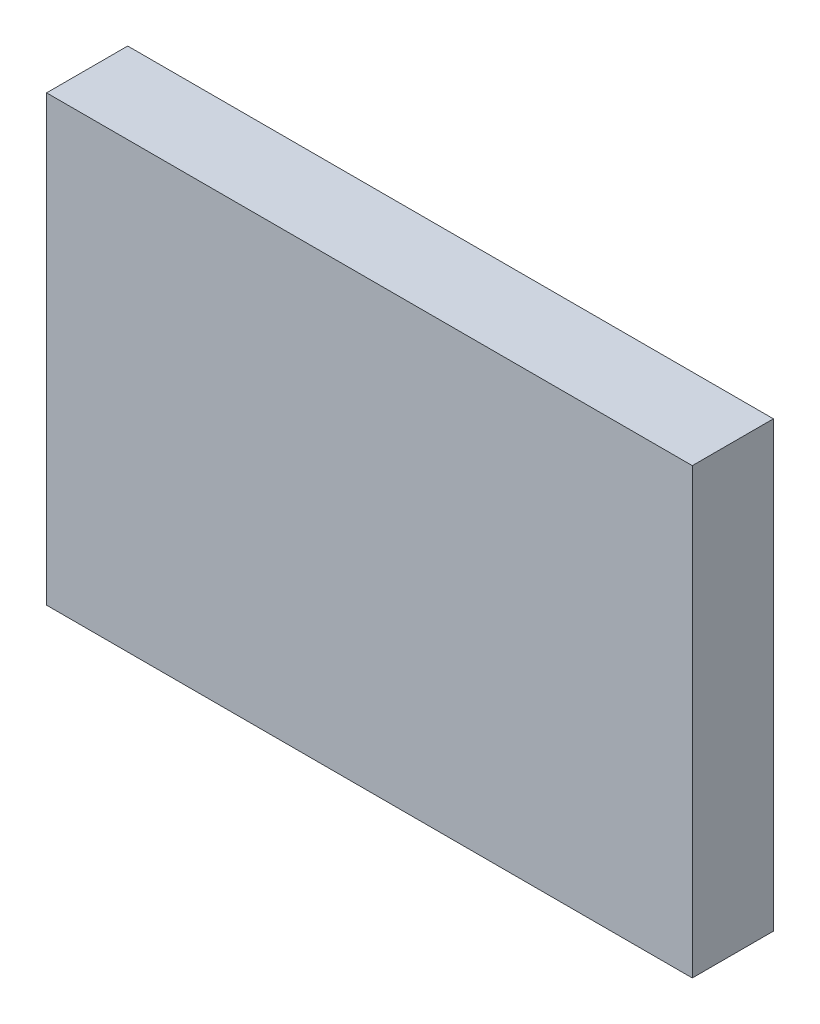
ISO-10303-21;
HEADER;
FILE_DESCRIPTION(('STEP AP214'),'2;1');
FILE_NAME('part.step','',(''),(''),'','','');
FILE_SCHEMA(('AUTOMOTIVE_DESIGN { 1 0 10303 214 1 1 1 1 }'));
ENDSEC;
DATA;
#1=APPLICATION_CONTEXT('core data for automotive mechanical design processes');
#2=APPLICATION_PROTOCOL_DEFINITION('international standard','automotive_design',2000,#1);
#3=PRODUCT_CONTEXT('',#1,'mechanical');
#4=PRODUCT('Part','Part','',(#3));
#5=PRODUCT_RELATED_PRODUCT_CATEGORY('part','',(#4));
#6=PRODUCT_DEFINITION_FORMATION('','',#4);
#7=PRODUCT_DEFINITION_CONTEXT('part definition',#1,'design');
#8=PRODUCT_DEFINITION('design','',#6,#7);
#9=PRODUCT_DEFINITION_SHAPE('','',#8);
#10=(LENGTH_UNIT() NAMED_UNIT(*) SI_UNIT(.MILLI.,.METRE.));
#11=(NAMED_UNIT(*) PLANE_ANGLE_UNIT() SI_UNIT($,.RADIAN.));
#12=(NAMED_UNIT(*) SI_UNIT($,.STERADIAN.) SOLID_ANGLE_UNIT());
#13=UNCERTAINTY_MEASURE_WITH_UNIT(LENGTH_MEASURE(1.E-05),#10,'distance_accuracy_value','');
#14=(GEOMETRIC_REPRESENTATION_CONTEXT(3) GLOBAL_UNCERTAINTY_ASSIGNED_CONTEXT((#13)) GLOBAL_UNIT_ASSIGNED_CONTEXT((#10,
#11,#12)) REPRESENTATION_CONTEXT('',''));
#15=CARTESIAN_POINT('',(0.,0.,0.));
#16=DIRECTION('',(0.,0.,1.));
#17=DIRECTION('',(1.,0.,0.));
#18=AXIS2_PLACEMENT_3D('',#15,#16,#17);
#19=CARTESIAN_POINT('',(1.143,-1.054,0.));
#20=DIRECTION('',(0.,-1.,0.));
#21=DIRECTION('',(0.,0.,-1.));
#22=AXIS2_PLACEMENT_3D('',#19,#20,#21);
#23=PLANE('',#22);
#24=DIRECTION('',(-1.,0.,0.));
#25=VECTOR('',#24,1.);
#26=CARTESIAN_POINT('',(1.549,-1.054,0.));
#27=LINE('',#26,#25);
#28=CARTESIAN_POINT('',(1.549,-1.054,0.));
#29=VERTEX_POINT('',#28);
#30=CARTESIAN_POINT('',(1.143,-1.054,0.));
#31=VERTEX_POINT('',#30);
#32=EDGE_CURVE('E11',#29,#31,#27,.T.);
#33=ORIENTED_EDGE('',*,*,#32,.F.);
#34=DIRECTION('',(0.,0.,-1.));
#35=VECTOR('',#34,1.);
#36=CARTESIAN_POINT('',(1.549,-1.054,0.051));
#37=LINE('',#36,#35);
#38=CARTESIAN_POINT('',(1.549,-1.054,0.051));
#39=VERTEX_POINT('',#38);
#40=EDGE_CURVE('E24',#39,#29,#37,.T.);
#41=ORIENTED_EDGE('',*,*,#40,.F.);
#42=DIRECTION('',(1.,0.,0.));
#43=VECTOR('',#42,1.);
#44=CARTESIAN_POINT('',(1.143,-1.054,0.051));
#45=LINE('',#44,#43);
#46=CARTESIAN_POINT('',(1.143,-1.054,0.051));
#47=VERTEX_POINT('',#46);
#48=EDGE_CURVE('E88',#47,#39,#45,.T.);
#49=ORIENTED_EDGE('',*,*,#48,.F.);
#50=DIRECTION('',(0.,0.,1.));
#51=VECTOR('',#50,1.);
#52=CARTESIAN_POINT('',(1.143,-1.054,0.));
#53=LINE('',#52,#51);
#54=EDGE_CURVE('E77',#31,#47,#53,.T.);
#55=ORIENTED_EDGE('',*,*,#54,.F.);
#56=EDGE_LOOP('',(#33,#41,#49,#55));
#57=FACE_BOUND('',#56,.T.);
#58=ADVANCED_FACE('F17',(#57),#23,.T.);
#59=CARTESIAN_POINT('',(1.549,-1.054,0.));
#60=DIRECTION('',(1.,0.,0.));
#61=DIRECTION('',(0.,1.,0.));
#62=AXIS2_PLACEMENT_3D('',#59,#60,#61);
#63=PLANE('',#62);
#64=DIRECTION('',(0.,-1.,0.));
#65=VECTOR('',#64,1.);
#66=CARTESIAN_POINT('',(1.549,-0.775,0.));
#67=LINE('',#66,#65);
#68=CARTESIAN_POINT('',(1.549,-0.775,0.));
#69=VERTEX_POINT('',#68);
#70=EDGE_CURVE('E85',#69,#29,#67,.T.);
#71=ORIENTED_EDGE('',*,*,#70,.F.);
#72=DIRECTION('',(0.,0.,-1.));
#73=VECTOR('',#72,1.);
#74=CARTESIAN_POINT('',(1.549,-0.775,0.051));
#75=LINE('',#74,#73);
#76=CARTESIAN_POINT('',(1.549,-0.775,0.051));
#77=VERTEX_POINT('',#76);
#78=EDGE_CURVE('E83',#77,#69,#75,.T.);
#79=ORIENTED_EDGE('',*,*,#78,.F.);
#80=DIRECTION('',(0.,1.,0.));
#81=VECTOR('',#80,1.);
#82=CARTESIAN_POINT('',(1.549,-1.054,0.051));
#83=LINE('',#82,#81);
#84=EDGE_CURVE('E72',#39,#77,#83,.T.);
#85=ORIENTED_EDGE('',*,*,#84,.F.);
#86=ORIENTED_EDGE('',*,*,#40,.T.);
#87=EDGE_LOOP('',(#71,#79,#85,#86));
#88=FACE_BOUND('',#87,.T.);
#89=ADVANCED_FACE('F90',(#88),#63,.T.);
#90=CARTESIAN_POINT('',(1.549,-0.775,0.));
#91=DIRECTION('',(0.,1.,0.));
#92=DIRECTION('',(1.,0.,0.));
#93=AXIS2_PLACEMENT_3D('',#90,#91,#92);
#94=PLANE('',#93);
#95=DIRECTION('',(1.,0.,0.));
#96=VECTOR('',#95,1.);
#97=CARTESIAN_POINT('',(1.143,-0.775,0.));
#98=LINE('',#97,#96);
#99=CARTESIAN_POINT('',(1.143,-0.775,0.));
#100=VERTEX_POINT('',#99);
#101=EDGE_CURVE('E60',#100,#69,#98,.T.);
#102=ORIENTED_EDGE('',*,*,#101,.F.);
#103=DIRECTION('',(0.,0.,-1.));
#104=VECTOR('',#103,1.);
#105=CARTESIAN_POINT('',(1.143,-0.775,0.051));
#106=LINE('',#105,#104);
#107=CARTESIAN_POINT('',(1.143,-0.775,0.051));
#108=VERTEX_POINT('',#107);
#109=EDGE_CURVE('E54',#108,#100,#106,.T.);
#110=ORIENTED_EDGE('',*,*,#109,.F.);
#111=DIRECTION('',(-1.,0.,0.));
#112=VECTOR('',#111,1.);
#113=CARTESIAN_POINT('',(1.549,-0.775,0.051));
#114=LINE('',#113,#112);
#115=EDGE_CURVE('E58',#77,#108,#114,.T.);
#116=ORIENTED_EDGE('',*,*,#115,.F.);
#117=ORIENTED_EDGE('',*,*,#78,.T.);
#118=EDGE_LOOP('',(#102,#110,#116,#117));
#119=FACE_BOUND('',#118,.T.);
#120=ADVANCED_FACE('F56',(#119),#94,.T.);
#121=CARTESIAN_POINT('',(1.143,-0.775,0.));
#122=DIRECTION('',(-1.,0.,0.));
#123=DIRECTION('',(0.,0.,1.));
#124=AXIS2_PLACEMENT_3D('',#121,#122,#123);
#125=PLANE('',#124);
#126=DIRECTION('',(0.,1.,0.));
#127=VECTOR('',#126,1.);
#128=CARTESIAN_POINT('',(1.143,-1.054,0.));
#129=LINE('',#128,#127);
#130=EDGE_CURVE('E73',#31,#100,#129,.T.);
#131=ORIENTED_EDGE('',*,*,#130,.F.);
#132=ORIENTED_EDGE('',*,*,#54,.T.);
#133=DIRECTION('',(0.,-1.,0.));
#134=VECTOR('',#133,1.);
#135=CARTESIAN_POINT('',(1.143,-0.775,0.051));
#136=LINE('',#135,#134);
#137=EDGE_CURVE('E70',#108,#47,#136,.T.);
#138=ORIENTED_EDGE('',*,*,#137,.F.);
#139=ORIENTED_EDGE('',*,*,#109,.T.);
#140=EDGE_LOOP('',(#131,#132,#138,#139));
#141=FACE_BOUND('',#140,.T.);
#142=ADVANCED_FACE('F76',(#141),#125,.T.);
#143=CARTESIAN_POINT('',(1.143,-0.775,0.));
#144=DIRECTION('',(0.,0.,-1.));
#145=DIRECTION('',(0.,-1.,0.));
#146=AXIS2_PLACEMENT_3D('',#143,#144,#145);
#147=PLANE('',#146);
#148=ORIENTED_EDGE('',*,*,#101,.T.);
#149=ORIENTED_EDGE('',*,*,#70,.T.);
#150=ORIENTED_EDGE('',*,*,#32,.T.);
#151=ORIENTED_EDGE('',*,*,#130,.T.);
#152=EDGE_LOOP('',(#148,#149,#150,#151));
#153=FACE_BOUND('',#152,.T.);
#154=ADVANCED_FACE('F91',(#153),#147,.T.);
#155=CARTESIAN_POINT('',(1.143,-1.054,0.051));
#156=DIRECTION('',(0.,0.,1.));
#157=DIRECTION('',(1.,0.,0.));
#158=AXIS2_PLACEMENT_3D('',#155,#156,#157);
#159=PLANE('',#158);
#160=ORIENTED_EDGE('',*,*,#48,.T.);
#161=ORIENTED_EDGE('',*,*,#84,.T.);
#162=ORIENTED_EDGE('',*,*,#115,.T.);
#163=ORIENTED_EDGE('',*,*,#137,.T.);
#164=EDGE_LOOP('',(#160,#161,#162,#163));
#165=FACE_BOUND('',#164,.T.);
#166=ADVANCED_FACE('F69',(#165),#159,.T.);
#167=CLOSED_SHELL('',(#58,#89,#120,#142,#154,#166));
#168=MANIFOLD_SOLID_BREP('B1',#167);
#169=ADVANCED_BREP_SHAPE_REPRESENTATION('',(#18,#168),#14);
#170=SHAPE_DEFINITION_REPRESENTATION(#9,#169);
ENDSEC;
END-ISO-10303-21;
